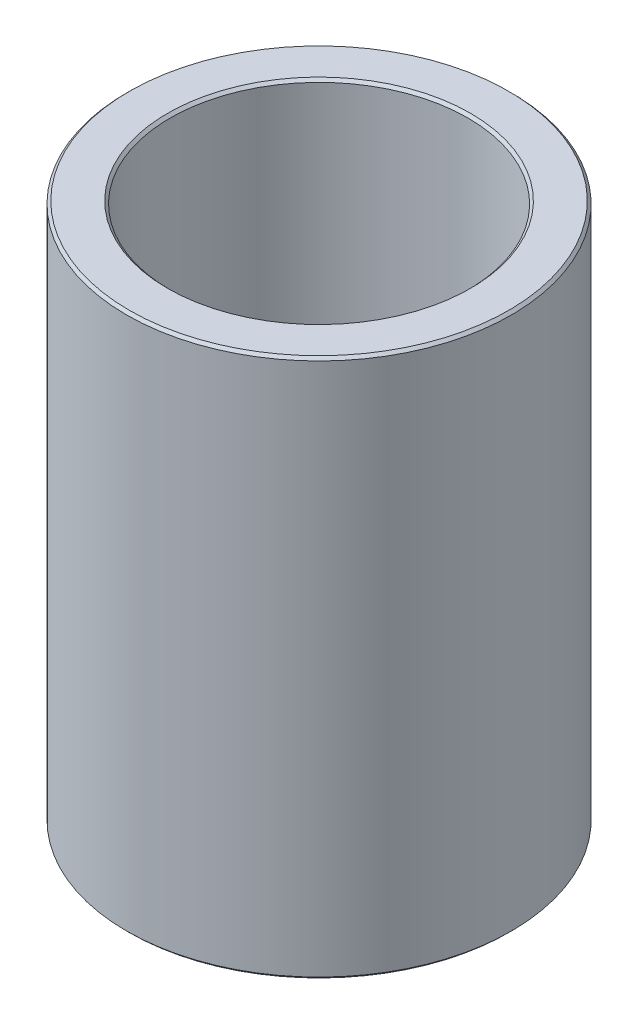
ISO-10303-21;
HEADER;
FILE_DESCRIPTION(('STEP AP214'),'2;1');
FILE_NAME('part.step','',(''),(''),'','','');
FILE_SCHEMA(('AUTOMOTIVE_DESIGN { 1 0 10303 214 1 1 1 1 }'));
ENDSEC;
DATA;
#1=APPLICATION_CONTEXT('core data for automotive mechanical design processes');
#2=APPLICATION_PROTOCOL_DEFINITION('international standard','automotive_design',2000,#1);
#3=PRODUCT_CONTEXT('',#1,'mechanical');
#4=PRODUCT('Part','Part','',(#3));
#5=PRODUCT_RELATED_PRODUCT_CATEGORY('part','',(#4));
#6=PRODUCT_DEFINITION_FORMATION('','',#4);
#7=PRODUCT_DEFINITION_CONTEXT('part definition',#1,'design');
#8=PRODUCT_DEFINITION('design','',#6,#7);
#9=PRODUCT_DEFINITION_SHAPE('','',#8);
#10=(LENGTH_UNIT() NAMED_UNIT(*) SI_UNIT(.MILLI.,.METRE.));
#11=(NAMED_UNIT(*) PLANE_ANGLE_UNIT() SI_UNIT($,.RADIAN.));
#12=(NAMED_UNIT(*) SI_UNIT($,.STERADIAN.) SOLID_ANGLE_UNIT());
#13=UNCERTAINTY_MEASURE_WITH_UNIT(LENGTH_MEASURE(1.E-05),#10,'distance_accuracy_value','');
#14=(GEOMETRIC_REPRESENTATION_CONTEXT(3) GLOBAL_UNCERTAINTY_ASSIGNED_CONTEXT((#13)) GLOBAL_UNIT_ASSIGNED_CONTEXT((#10,
#11,#12)) REPRESENTATION_CONTEXT('',''));
#15=CARTESIAN_POINT('',(0.,0.,0.));
#16=DIRECTION('',(0.,0.,1.));
#17=DIRECTION('',(1.,0.,0.));
#18=AXIS2_PLACEMENT_3D('',#15,#16,#17);
#19=CARTESIAN_POINT('',(0.,161.072596288477,0.));
#20=DIRECTION('',(0.,-1.,0.));
#21=DIRECTION('',(0.,0.,-1.));
#22=AXIS2_PLACEMENT_3D('',#19,#20,#21);
#23=CYLINDRICAL_SURFACE('',#22,57.5);
#24=CARTESIAN_POINT('',(0.,0.802652887096217,0.));
#25=DIRECTION('',(0.,1.,0.));
#26=DIRECTION('',(0.,0.,1.));
#27=AXIS2_PLACEMENT_3D('',#24,#25,#26);
#28=CIRCLE('',#27,57.5);
#29=CARTESIAN_POINT('',(0.,0.802652887096217,57.5));
#30=VERTEX_POINT('',#29);
#31=EDGE_CURVE('E10',#30,#30,#28,.T.);
#32=ORIENTED_EDGE('',*,*,#31,.T.);
#33=EDGE_LOOP('',(#32));
#34=FACE_BOUND('',#33,.T.);
#35=CARTESIAN_POINT('',(0.,160.269943401381,0.));
#36=DIRECTION('',(0.,1.,0.));
#37=DIRECTION('',(0.,0.,1.));
#38=AXIS2_PLACEMENT_3D('',#35,#36,#37);
#39=CIRCLE('',#38,57.5);
#40=CARTESIAN_POINT('',(0.,160.269943401381,57.5));
#41=VERTEX_POINT('',#40);
#42=EDGE_CURVE('E50',#41,#41,#39,.F.);
#43=ORIENTED_EDGE('',*,*,#42,.T.);
#44=EDGE_LOOP('',(#43));
#45=FACE_BOUND('',#44,.T.);
#46=ADVANCED_FACE('F39',(#34,#45),#23,.T.);
#47=CARTESIAN_POINT('',(0.,161.072596288477,0.));
#48=DIRECTION('',(0.,1.,0.));
#49=DIRECTION('',(0.,0.,1.));
#50=AXIS2_PLACEMENT_3D('',#47,#48,#49);
#51=PLANE('',#50);
#52=CARTESIAN_POINT('',(0.,161.072596288477,0.));
#53=DIRECTION('',(0.,1.,0.));
#54=DIRECTION('',(0.,0.,1.));
#55=AXIS2_PLACEMENT_3D('',#52,#53,#54);
#56=CIRCLE('',#55,45.3027457918229);
#57=CARTESIAN_POINT('',(0.,161.072596288477,45.3027457918229));
#58=VERTEX_POINT('',#57);
#59=EDGE_CURVE('E58',#58,#58,#56,.F.);
#60=ORIENTED_EDGE('',*,*,#59,.T.);
#61=EDGE_LOOP('',(#60));
#62=FACE_BOUND('',#61,.T.);
#63=CARTESIAN_POINT('',(0.,161.072596288477,0.));
#64=DIRECTION('',(0.,1.,0.));
#65=DIRECTION('',(0.,0.,1.));
#66=AXIS2_PLACEMENT_3D('',#63,#64,#65);
#67=CIRCLE('',#66,56.6973471129037);
#68=CARTESIAN_POINT('',(0.,161.072596288477,56.6973471129037));
#69=VERTEX_POINT('',#68);
#70=EDGE_CURVE('E61',#69,#69,#67,.T.);
#71=ORIENTED_EDGE('',*,*,#70,.T.);
#72=EDGE_LOOP('',(#71));
#73=FACE_BOUND('',#72,.T.);
#74=ADVANCED_FACE('F88',(#62,#73),#51,.T.);
#75=CARTESIAN_POINT('',(0.,0.,0.));
#76=DIRECTION('',(0.,1.,0.));
#77=DIRECTION('',(0.,0.,1.));
#78=AXIS2_PLACEMENT_3D('',#75,#76,#77);
#79=PLANE('',#78);
#80=CARTESIAN_POINT('',(0.,0.,0.));
#81=DIRECTION('',(0.,1.,0.));
#82=DIRECTION('',(0.,0.,1.));
#83=AXIS2_PLACEMENT_3D('',#80,#81,#82);
#84=CIRCLE('',#83,45.3027457918229);
#85=CARTESIAN_POINT('',(0.,0.,45.3027457918229));
#86=VERTEX_POINT('',#85);
#87=EDGE_CURVE('E51',#86,#86,#84,.T.);
#88=ORIENTED_EDGE('',*,*,#87,.T.);
#89=EDGE_LOOP('',(#88));
#90=FACE_BOUND('',#89,.T.);
#91=CARTESIAN_POINT('',(0.,0.,0.));
#92=DIRECTION('',(0.,1.,0.));
#93=DIRECTION('',(0.,0.,1.));
#94=AXIS2_PLACEMENT_3D('',#91,#92,#93);
#95=CIRCLE('',#94,56.6973471129038);
#96=CARTESIAN_POINT('',(0.,0.,56.6973471129038));
#97=VERTEX_POINT('',#96);
#98=EDGE_CURVE('E54',#97,#97,#95,.F.);
#99=ORIENTED_EDGE('',*,*,#98,.T.);
#100=EDGE_LOOP('',(#99));
#101=FACE_BOUND('',#100,.T.);
#102=ADVANCED_FACE('F83',(#90,#101),#79,.F.);
#103=CARTESIAN_POINT('',(0.,161.072596288477,0.));
#104=DIRECTION('',(0.,-1.,0.));
#105=DIRECTION('',(0.,0.,-1.));
#106=AXIS2_PLACEMENT_3D('',#103,#104,#105);
#107=CYLINDRICAL_SURFACE('',#106,44.5000929047267);
#108=CARTESIAN_POINT('',(0.,160.269943401381,0.));
#109=DIRECTION('',(0.,1.,0.));
#110=DIRECTION('',(0.,0.,1.));
#111=AXIS2_PLACEMENT_3D('',#108,#109,#110);
#112=CIRCLE('',#111,44.5000929047267);
#113=CARTESIAN_POINT('',(0.,160.269943401381,44.5000929047267));
#114=VERTEX_POINT('',#113);
#115=EDGE_CURVE('E67',#114,#114,#112,.T.);
#116=ORIENTED_EDGE('',*,*,#115,.T.);
#117=EDGE_LOOP('',(#116));
#118=FACE_BOUND('',#117,.T.);
#119=CARTESIAN_POINT('',(0.,0.802652887096245,0.));
#120=DIRECTION('',(0.,1.,0.));
#121=DIRECTION('',(0.,0.,1.));
#122=AXIS2_PLACEMENT_3D('',#119,#120,#121);
#123=CIRCLE('',#122,44.5000929047267);
#124=CARTESIAN_POINT('',(0.,0.802652887096245,44.5000929047267));
#125=VERTEX_POINT('',#124);
#126=EDGE_CURVE('E69',#125,#125,#123,.F.);
#127=ORIENTED_EDGE('',*,*,#126,.T.);
#128=EDGE_LOOP('',(#127));
#129=FACE_BOUND('',#128,.T.);
#130=ADVANCED_FACE('F71',(#118,#129),#107,.F.);
#131=CARTESIAN_POINT('',(0.,160.269943401381,0.));
#132=DIRECTION('',(0.,1.,0.));
#133=DIRECTION('',(0.,0.,1.));
#134=AXIS2_PLACEMENT_3D('',#131,#132,#133);
#135=CONICAL_SURFACE('',#134,44.5000929047267,0.78539816339744);
#136=ORIENTED_EDGE('',*,*,#59,.F.);
#137=EDGE_LOOP('',(#136));
#138=FACE_BOUND('',#137,.T.);
#139=ORIENTED_EDGE('',*,*,#115,.F.);
#140=EDGE_LOOP('',(#139));
#141=FACE_BOUND('',#140,.T.);
#142=ADVANCED_FACE('F77',(#138,#141),#135,.F.);
#143=CARTESIAN_POINT('',(0.,0.,0.));
#144=DIRECTION('',(0.,-1.,0.));
#145=DIRECTION('',(0.,0.,-1.));
#146=AXIS2_PLACEMENT_3D('',#143,#144,#145);
#147=CONICAL_SURFACE('',#146,45.3027457918229,0.78539816339744);
#148=ORIENTED_EDGE('',*,*,#126,.F.);
#149=EDGE_LOOP('',(#148));
#150=FACE_BOUND('',#149,.T.);
#151=ORIENTED_EDGE('',*,*,#87,.F.);
#152=EDGE_LOOP('',(#151));
#153=FACE_BOUND('',#152,.T.);
#154=ADVANCED_FACE('F73',(#150,#153),#147,.F.);
#155=CARTESIAN_POINT('',(0.,0.802652887096217,0.));
#156=DIRECTION('',(0.,1.,0.));
#157=DIRECTION('',(0.,0.,1.));
#158=AXIS2_PLACEMENT_3D('',#155,#156,#157);
#159=CONICAL_SURFACE('',#158,57.5,0.785398163397457);
#160=ORIENTED_EDGE('',*,*,#98,.F.);
#161=EDGE_LOOP('',(#160));
#162=FACE_BOUND('',#161,.T.);
#163=ORIENTED_EDGE('',*,*,#31,.F.);
#164=EDGE_LOOP('',(#163));
#165=FACE_BOUND('',#164,.T.);
#166=ADVANCED_FACE('F76',(#162,#165),#159,.T.);
#167=CARTESIAN_POINT('',(0.,161.072596288477,0.));
#168=DIRECTION('',(0.,-1.,0.));
#169=DIRECTION('',(0.,0.,-1.));
#170=AXIS2_PLACEMENT_3D('',#167,#168,#169);
#171=CONICAL_SURFACE('',#170,56.6973471129037,0.785398163397457);
#172=ORIENTED_EDGE('',*,*,#42,.F.);
#173=EDGE_LOOP('',(#172));
#174=FACE_BOUND('',#173,.T.);
#175=ORIENTED_EDGE('',*,*,#70,.F.);
#176=EDGE_LOOP('',(#175));
#177=FACE_BOUND('',#176,.T.);
#178=ADVANCED_FACE('F45',(#174,#177),#171,.T.);
#179=CLOSED_SHELL('',(#46,#74,#102,#130,#142,#154,#166,#178));
#180=MANIFOLD_SOLID_BREP('B2',#179);
#181=ADVANCED_BREP_SHAPE_REPRESENTATION('',(#18,#180),#14);
#182=SHAPE_DEFINITION_REPRESENTATION(#9,#181);
ENDSEC;
END-ISO-10303-21;
